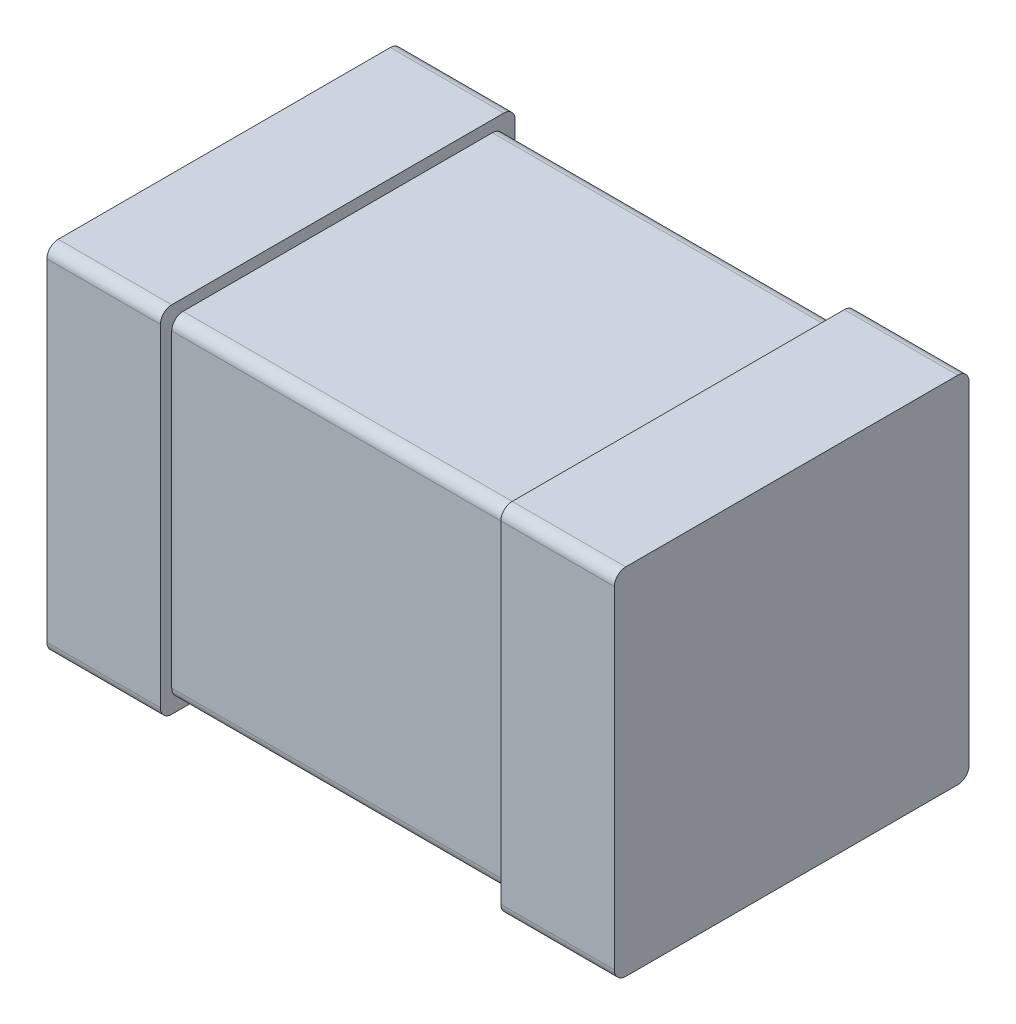
ISO-10303-21;
HEADER;
FILE_DESCRIPTION(('STEP AP214'),'2;1');
FILE_NAME('part.step','',(''),(''),'','','');
FILE_SCHEMA(('AUTOMOTIVE_DESIGN { 1 0 10303 214 1 1 1 1 }'));
ENDSEC;
DATA;
#1=APPLICATION_CONTEXT('core data for automotive mechanical design processes');
#2=APPLICATION_PROTOCOL_DEFINITION('international standard','automotive_design',2000,#1);
#3=PRODUCT_CONTEXT('',#1,'mechanical');
#4=PRODUCT('Part','Part','',(#3));
#5=PRODUCT_RELATED_PRODUCT_CATEGORY('part','',(#4));
#6=PRODUCT_DEFINITION_FORMATION('','',#4);
#7=PRODUCT_DEFINITION_CONTEXT('part definition',#1,'design');
#8=PRODUCT_DEFINITION('design','',#6,#7);
#9=PRODUCT_DEFINITION_SHAPE('','',#8);
#10=(LENGTH_UNIT() NAMED_UNIT(*) SI_UNIT(.MILLI.,.METRE.));
#11=(NAMED_UNIT(*) PLANE_ANGLE_UNIT() SI_UNIT($,.RADIAN.));
#12=(NAMED_UNIT(*) SI_UNIT($,.STERADIAN.) SOLID_ANGLE_UNIT());
#13=UNCERTAINTY_MEASURE_WITH_UNIT(LENGTH_MEASURE(1.E-05),#10,'distance_accuracy_value','');
#14=(GEOMETRIC_REPRESENTATION_CONTEXT(3) GLOBAL_UNCERTAINTY_ASSIGNED_CONTEXT((#13)) GLOBAL_UNIT_ASSIGNED_CONTEXT((#10,
#11,#12)) REPRESENTATION_CONTEXT('',''));
#15=CARTESIAN_POINT('',(0.,0.,0.));
#16=DIRECTION('',(0.,0.,1.));
#17=DIRECTION('',(1.,0.,0.));
#18=AXIS2_PLACEMENT_3D('',#15,#16,#17);
#19=CARTESIAN_POINT('',(1.,-0.625,0.));
#20=DIRECTION('',(1.,0.,0.));
#21=DIRECTION('',(0.,1.,0.));
#22=AXIS2_PLACEMENT_3D('',#19,#20,#21);
#23=PLANE('',#22);
#24=DIRECTION('',(0.,0.,1.));
#25=VECTOR('',#24,1.);
#26=CARTESIAN_POINT('',(1.,-0.625,0.));
#27=LINE('',#26,#25);
#28=CARTESIAN_POINT('',(1.,-0.625,0.04));
#29=VERTEX_POINT('',#28);
#30=CARTESIAN_POINT('',(1.,-0.625,1.21));
#31=VERTEX_POINT('',#30);
#32=EDGE_CURVE('E333',#29,#31,#27,.T.);
#33=ORIENTED_EDGE('',*,*,#32,.F.);
#34=CARTESIAN_POINT('',(1.,-0.585,0.04));
#35=DIRECTION('',(1.,0.,0.));
#36=DIRECTION('',(0.,0.,1.));
#37=AXIS2_PLACEMENT_3D('',#34,#35,#36);
#38=CIRCLE('',#37,0.04);
#39=CARTESIAN_POINT('',(1.,-0.585,0.));
#40=VERTEX_POINT('',#39);
#41=EDGE_CURVE('E315',#29,#40,#38,.T.);
#42=ORIENTED_EDGE('',*,*,#41,.T.);
#43=DIRECTION('',(0.,1.,0.));
#44=VECTOR('',#43,1.);
#45=CARTESIAN_POINT('',(1.,-0.625,0.));
#46=LINE('',#45,#44);
#47=CARTESIAN_POINT('',(1.,0.585,0.));
#48=VERTEX_POINT('',#47);
#49=EDGE_CURVE('E302',#40,#48,#46,.T.);
#50=ORIENTED_EDGE('',*,*,#49,.T.);
#51=CARTESIAN_POINT('',(1.,0.585,0.04));
#52=DIRECTION('',(-1.,0.,0.));
#53=DIRECTION('',(0.,0.,1.));
#54=AXIS2_PLACEMENT_3D('',#51,#52,#53);
#55=CIRCLE('',#54,0.04);
#56=CARTESIAN_POINT('',(1.,0.625,0.04));
#57=VERTEX_POINT('',#56);
#58=EDGE_CURVE('E207',#57,#48,#55,.T.);
#59=ORIENTED_EDGE('',*,*,#58,.F.);
#60=DIRECTION('',(0.,0.,1.));
#61=VECTOR('',#60,1.);
#62=CARTESIAN_POINT('',(1.,0.625,0.));
#63=LINE('',#62,#61);
#64=CARTESIAN_POINT('',(1.,0.625,1.21));
#65=VERTEX_POINT('',#64);
#66=EDGE_CURVE('E11',#57,#65,#63,.T.);
#67=ORIENTED_EDGE('',*,*,#66,.T.);
#68=CARTESIAN_POINT('',(1.,0.585,1.21));
#69=DIRECTION('',(1.,0.,0.));
#70=DIRECTION('',(0.,0.,1.));
#71=AXIS2_PLACEMENT_3D('',#68,#69,#70);
#72=CIRCLE('',#71,0.04);
#73=CARTESIAN_POINT('',(1.,0.585,1.25));
#74=VERTEX_POINT('',#73);
#75=EDGE_CURVE('E197',#65,#74,#72,.T.);
#76=ORIENTED_EDGE('',*,*,#75,.T.);
#77=DIRECTION('',(0.,1.,0.));
#78=VECTOR('',#77,1.);
#79=CARTESIAN_POINT('',(1.,-0.625,1.25));
#80=LINE('',#79,#78);
#81=CARTESIAN_POINT('',(1.,-0.585,1.25));
#82=VERTEX_POINT('',#81);
#83=EDGE_CURVE('E305',#82,#74,#80,.T.);
#84=ORIENTED_EDGE('',*,*,#83,.F.);
#85=CARTESIAN_POINT('',(1.,-0.585,1.21));
#86=DIRECTION('',(-1.,0.,0.));
#87=DIRECTION('',(0.,0.,1.));
#88=AXIS2_PLACEMENT_3D('',#85,#86,#87);
#89=CIRCLE('',#88,0.04);
#90=EDGE_CURVE('E311',#31,#82,#89,.T.);
#91=ORIENTED_EDGE('',*,*,#90,.F.);
#92=EDGE_LOOP('',(#33,#42,#50,#59,#67,#76,#84,#91));
#93=FACE_BOUND('',#92,.T.);
#94=ADVANCED_FACE('F16',(#93),#23,.T.);
#95=CARTESIAN_POINT('',(0.6,0.625,0.));
#96=DIRECTION('',(0.,1.,0.));
#97=DIRECTION('',(1.,0.,0.));
#98=AXIS2_PLACEMENT_3D('',#95,#96,#97);
#99=PLANE('',#98);
#100=ORIENTED_EDGE('',*,*,#66,.F.);
#101=DIRECTION('',(1.,0.,0.));
#102=VECTOR('',#101,1.);
#103=CARTESIAN_POINT('',(0.6,0.625,0.04));
#104=LINE('',#103,#102);
#105=CARTESIAN_POINT('',(0.6,0.625,0.04));
#106=VERTEX_POINT('',#105);
#107=EDGE_CURVE('E344',#106,#57,#104,.T.);
#108=ORIENTED_EDGE('',*,*,#107,.F.);
#109=DIRECTION('',(0.,0.,1.));
#110=VECTOR('',#109,1.);
#111=CARTESIAN_POINT('',(0.6,0.625,0.));
#112=LINE('',#111,#110);
#113=CARTESIAN_POINT('',(0.6,0.625,1.21));
#114=VERTEX_POINT('',#113);
#115=EDGE_CURVE('E390',#106,#114,#112,.T.);
#116=ORIENTED_EDGE('',*,*,#115,.T.);
#117=DIRECTION('',(1.,0.,0.));
#118=VECTOR('',#117,1.);
#119=CARTESIAN_POINT('',(0.6,0.625,1.21));
#120=LINE('',#119,#118);
#121=EDGE_CURVE('E27',#114,#65,#120,.T.);
#122=ORIENTED_EDGE('',*,*,#121,.T.);
#123=EDGE_LOOP('',(#100,#108,#116,#122));
#124=FACE_BOUND('',#123,.T.);
#125=ADVANCED_FACE('F578',(#124),#99,.T.);
#126=CARTESIAN_POINT('',(0.6,0.585,1.21));
#127=DIRECTION('',(1.,0.,0.));
#128=DIRECTION('',(0.,1.,0.));
#129=AXIS2_PLACEMENT_3D('',#126,#127,#128);
#130=CYLINDRICAL_SURFACE('',#129,0.04);
#131=CARTESIAN_POINT('',(0.6,0.585,1.21));
#132=DIRECTION('',(1.,0.,0.));
#133=DIRECTION('',(0.,0.,1.));
#134=AXIS2_PLACEMENT_3D('',#131,#132,#133);
#135=CIRCLE('',#134,0.04);
#136=CARTESIAN_POINT('',(0.6,0.585,1.25));
#137=VERTEX_POINT('',#136);
#138=EDGE_CURVE('E441',#114,#137,#135,.T.);
#139=ORIENTED_EDGE('',*,*,#138,.T.);
#140=DIRECTION('',(1.,0.,0.));
#141=VECTOR('',#140,1.);
#142=CARTESIAN_POINT('',(0.6,0.585,1.25));
#143=LINE('',#142,#141);
#144=EDGE_CURVE('E347',#137,#74,#143,.T.);
#145=ORIENTED_EDGE('',*,*,#144,.T.);
#146=ORIENTED_EDGE('',*,*,#75,.F.);
#147=ORIENTED_EDGE('',*,*,#121,.F.);
#148=EDGE_LOOP('',(#139,#145,#146,#147));
#149=FACE_BOUND('',#148,.T.);
#150=ADVANCED_FACE('F583',(#149),#130,.T.);
#151=CARTESIAN_POINT('',(0.6,0.585,0.04));
#152=DIRECTION('',(1.,0.,0.));
#153=DIRECTION('',(0.,1.,0.));
#154=AXIS2_PLACEMENT_3D('',#151,#152,#153);
#155=CYLINDRICAL_SURFACE('',#154,0.04);
#156=ORIENTED_EDGE('',*,*,#107,.T.);
#157=ORIENTED_EDGE('',*,*,#58,.T.);
#158=DIRECTION('',(1.,0.,0.));
#159=VECTOR('',#158,1.);
#160=CARTESIAN_POINT('',(0.6,0.585,0.));
#161=LINE('',#160,#159);
#162=CARTESIAN_POINT('',(0.6,0.585,0.));
#163=VERTEX_POINT('',#162);
#164=EDGE_CURVE('E306',#163,#48,#161,.T.);
#165=ORIENTED_EDGE('',*,*,#164,.F.);
#166=CARTESIAN_POINT('',(0.6,0.585,0.04));
#167=DIRECTION('',(-1.,0.,0.));
#168=DIRECTION('',(0.,0.,1.));
#169=AXIS2_PLACEMENT_3D('',#166,#167,#168);
#170=CIRCLE('',#169,0.04);
#171=EDGE_CURVE('E386',#106,#163,#170,.T.);
#172=ORIENTED_EDGE('',*,*,#171,.F.);
#173=EDGE_LOOP('',(#156,#157,#165,#172));
#174=FACE_BOUND('',#173,.T.);
#175=ADVANCED_FACE('F655',(#174),#155,.T.);
#176=CARTESIAN_POINT('',(0.6,-0.625,1.25));
#177=DIRECTION('',(0.,0.,1.));
#178=DIRECTION('',(1.,0.,0.));
#179=AXIS2_PLACEMENT_3D('',#176,#177,#178);
#180=PLANE('',#179);
#181=DIRECTION('',(0.,1.,0.));
#182=VECTOR('',#181,1.);
#183=CARTESIAN_POINT('',(0.6,-0.625,1.25));
#184=LINE('',#183,#182);
#185=CARTESIAN_POINT('',(0.6,-0.585,1.25));
#186=VERTEX_POINT('',#185);
#187=EDGE_CURVE('E437',#186,#137,#184,.T.);
#188=ORIENTED_EDGE('',*,*,#187,.F.);
#189=DIRECTION('',(1.,0.,0.));
#190=VECTOR('',#189,1.);
#191=CARTESIAN_POINT('',(0.6,-0.585,1.25));
#192=LINE('',#191,#190);
#193=EDGE_CURVE('E307',#186,#82,#192,.T.);
#194=ORIENTED_EDGE('',*,*,#193,.T.);
#195=ORIENTED_EDGE('',*,*,#83,.T.);
#196=ORIENTED_EDGE('',*,*,#144,.F.);
#197=EDGE_LOOP('',(#188,#194,#195,#196));
#198=FACE_BOUND('',#197,.T.);
#199=ADVANCED_FACE('F669',(#198),#180,.T.);
#200=CARTESIAN_POINT('',(0.6,-0.625,0.));
#201=DIRECTION('',(0.,0.,1.));
#202=DIRECTION('',(1.,0.,0.));
#203=AXIS2_PLACEMENT_3D('',#200,#201,#202);
#204=PLANE('',#203);
#205=ORIENTED_EDGE('',*,*,#164,.T.);
#206=ORIENTED_EDGE('',*,*,#49,.F.);
#207=DIRECTION('',(1.,0.,0.));
#208=VECTOR('',#207,1.);
#209=CARTESIAN_POINT('',(0.6,-0.585,0.));
#210=LINE('',#209,#208);
#211=CARTESIAN_POINT('',(0.6,-0.585,0.));
#212=VERTEX_POINT('',#211);
#213=EDGE_CURVE('E337',#212,#40,#210,.T.);
#214=ORIENTED_EDGE('',*,*,#213,.F.);
#215=DIRECTION('',(0.,1.,0.));
#216=VECTOR('',#215,1.);
#217=CARTESIAN_POINT('',(0.6,-0.625,0.));
#218=LINE('',#217,#216);
#219=EDGE_CURVE('E375',#212,#163,#218,.T.);
#220=ORIENTED_EDGE('',*,*,#219,.T.);
#221=EDGE_LOOP('',(#205,#206,#214,#220));
#222=FACE_BOUND('',#221,.T.);
#223=ADVANCED_FACE('F663',(#222),#204,.F.);
#224=CARTESIAN_POINT('',(0.6,-0.585,1.21));
#225=DIRECTION('',(1.,0.,0.));
#226=DIRECTION('',(0.,-1.,0.));
#227=AXIS2_PLACEMENT_3D('',#224,#225,#226);
#228=CYLINDRICAL_SURFACE('',#227,0.04);
#229=DIRECTION('',(1.,0.,0.));
#230=VECTOR('',#229,1.);
#231=CARTESIAN_POINT('',(0.6,-0.625,1.21));
#232=LINE('',#231,#230);
#233=CARTESIAN_POINT('',(0.6,-0.625,1.21));
#234=VERTEX_POINT('',#233);
#235=EDGE_CURVE('E276',#234,#31,#232,.T.);
#236=ORIENTED_EDGE('',*,*,#235,.T.);
#237=ORIENTED_EDGE('',*,*,#90,.T.);
#238=ORIENTED_EDGE('',*,*,#193,.F.);
#239=CARTESIAN_POINT('',(0.6,-0.585,1.21));
#240=DIRECTION('',(-1.,0.,0.));
#241=DIRECTION('',(0.,0.,1.));
#242=AXIS2_PLACEMENT_3D('',#239,#240,#241);
#243=CIRCLE('',#242,0.04);
#244=EDGE_CURVE('E378',#234,#186,#243,.T.);
#245=ORIENTED_EDGE('',*,*,#244,.F.);
#246=EDGE_LOOP('',(#236,#237,#238,#245));
#247=FACE_BOUND('',#246,.T.);
#248=ADVANCED_FACE('F668',(#247),#228,.T.);
#249=CARTESIAN_POINT('',(0.6,-0.585,0.04));
#250=DIRECTION('',(1.,0.,0.));
#251=DIRECTION('',(0.,-1.,0.));
#252=AXIS2_PLACEMENT_3D('',#249,#250,#251);
#253=CYLINDRICAL_SURFACE('',#252,0.04);
#254=CARTESIAN_POINT('',(0.6,-0.585,0.04));
#255=DIRECTION('',(1.,0.,0.));
#256=DIRECTION('',(0.,0.,1.));
#257=AXIS2_PLACEMENT_3D('',#254,#255,#256);
#258=CIRCLE('',#257,0.04);
#259=CARTESIAN_POINT('',(0.6,-0.625,0.04));
#260=VERTEX_POINT('',#259);
#261=EDGE_CURVE('E323',#260,#212,#258,.T.);
#262=ORIENTED_EDGE('',*,*,#261,.T.);
#263=ORIENTED_EDGE('',*,*,#213,.T.);
#264=ORIENTED_EDGE('',*,*,#41,.F.);
#265=DIRECTION('',(1.,0.,0.));
#266=VECTOR('',#265,1.);
#267=CARTESIAN_POINT('',(0.6,-0.625,0.04));
#268=LINE('',#267,#266);
#269=EDGE_CURVE('E280',#260,#29,#268,.T.);
#270=ORIENTED_EDGE('',*,*,#269,.F.);
#271=EDGE_LOOP('',(#262,#263,#264,#270));
#272=FACE_BOUND('',#271,.T.);
#273=ADVANCED_FACE('F597',(#272),#253,.T.);
#274=CARTESIAN_POINT('',(0.6,-0.625,0.));
#275=DIRECTION('',(0.,1.,0.));
#276=DIRECTION('',(1.,0.,0.));
#277=AXIS2_PLACEMENT_3D('',#274,#275,#276);
#278=PLANE('',#277);
#279=ORIENTED_EDGE('',*,*,#235,.F.);
#280=DIRECTION('',(0.,0.,1.));
#281=VECTOR('',#280,1.);
#282=CARTESIAN_POINT('',(0.6,-0.625,0.));
#283=LINE('',#282,#281);
#284=EDGE_CURVE('E281',#260,#234,#283,.T.);
#285=ORIENTED_EDGE('',*,*,#284,.F.);
#286=ORIENTED_EDGE('',*,*,#269,.T.);
#287=ORIENTED_EDGE('',*,*,#32,.T.);
#288=EDGE_LOOP('',(#279,#285,#286,#287));
#289=FACE_BOUND('',#288,.T.);
#290=ADVANCED_FACE('F592',(#289),#278,.F.);
#291=CARTESIAN_POINT('',(0.6,-0.625,0.));
#292=DIRECTION('',(1.,0.,0.));
#293=DIRECTION('',(0.,1.,0.));
#294=AXIS2_PLACEMENT_3D('',#291,#292,#293);
#295=PLANE('',#294);
#296=DIRECTION('',(0.,1.,0.));
#297=VECTOR('',#296,1.);
#298=CARTESIAN_POINT('',(0.6,-0.585,0.04));
#299=LINE('',#298,#297);
#300=CARTESIAN_POINT('',(0.6,-0.545,0.04));
#301=VERTEX_POINT('',#300);
#302=CARTESIAN_POINT('',(0.6,0.545,0.04));
#303=VERTEX_POINT('',#302);
#304=EDGE_CURVE('E327',#301,#303,#299,.T.);
#305=ORIENTED_EDGE('',*,*,#304,.T.);
#306=CARTESIAN_POINT('',(0.6,0.545,0.08));
#307=DIRECTION('',(-1.,0.,0.));
#308=DIRECTION('',(0.,0.,1.));
#309=AXIS2_PLACEMENT_3D('',#306,#307,#308);
#310=CIRCLE('',#309,0.04);
#311=CARTESIAN_POINT('',(0.6,0.585,0.08));
#312=VERTEX_POINT('',#311);
#313=EDGE_CURVE('E358',#312,#303,#310,.T.);
#314=ORIENTED_EDGE('',*,*,#313,.F.);
#315=DIRECTION('',(0.,0.,1.));
#316=VECTOR('',#315,1.);
#317=CARTESIAN_POINT('',(0.6,0.585,0.04));
#318=LINE('',#317,#316);
#319=CARTESIAN_POINT('',(0.6,0.585,1.17));
#320=VERTEX_POINT('',#319);
#321=EDGE_CURVE('E188',#312,#320,#318,.T.);
#322=ORIENTED_EDGE('',*,*,#321,.T.);
#323=CARTESIAN_POINT('',(0.6,0.545,1.17));
#324=DIRECTION('',(1.,0.,0.));
#325=DIRECTION('',(0.,0.,1.));
#326=AXIS2_PLACEMENT_3D('',#323,#324,#325);
#327=CIRCLE('',#326,0.04);
#328=CARTESIAN_POINT('',(0.6,0.545,1.21));
#329=VERTEX_POINT('',#328);
#330=EDGE_CURVE('E178',#320,#329,#327,.T.);
#331=ORIENTED_EDGE('',*,*,#330,.T.);
#332=DIRECTION('',(0.,1.,0.));
#333=VECTOR('',#332,1.);
#334=CARTESIAN_POINT('',(0.6,-0.585,1.21));
#335=LINE('',#334,#333);
#336=CARTESIAN_POINT('',(0.6,-0.545,1.21));
#337=VERTEX_POINT('',#336);
#338=EDGE_CURVE('E274',#337,#329,#335,.T.);
#339=ORIENTED_EDGE('',*,*,#338,.F.);
#340=CARTESIAN_POINT('',(0.6,-0.545,1.17));
#341=DIRECTION('',(-1.,0.,0.));
#342=DIRECTION('',(0.,0.,1.));
#343=AXIS2_PLACEMENT_3D('',#340,#341,#342);
#344=CIRCLE('',#343,0.04);
#345=CARTESIAN_POINT('',(0.6,-0.585,1.17));
#346=VERTEX_POINT('',#345);
#347=EDGE_CURVE('E273',#346,#337,#344,.T.);
#348=ORIENTED_EDGE('',*,*,#347,.F.);
#349=DIRECTION('',(0.,0.,1.));
#350=VECTOR('',#349,1.);
#351=CARTESIAN_POINT('',(0.6,-0.585,0.04));
#352=LINE('',#351,#350);
#353=CARTESIAN_POINT('',(0.6,-0.585,0.08));
#354=VERTEX_POINT('',#353);
#355=EDGE_CURVE('E295',#354,#346,#352,.T.);
#356=ORIENTED_EDGE('',*,*,#355,.F.);
#357=CARTESIAN_POINT('',(0.6,-0.545,0.08));
#358=DIRECTION('',(1.,0.,0.));
#359=DIRECTION('',(0.,0.,1.));
#360=AXIS2_PLACEMENT_3D('',#357,#358,#359);
#361=CIRCLE('',#360,0.04);
#362=EDGE_CURVE('E447',#354,#301,#361,.T.);
#363=ORIENTED_EDGE('',*,*,#362,.T.);
#364=EDGE_LOOP('',(#305,#314,#322,#331,#339,#348,#356,#363));
#365=FACE_BOUND('',#364,.T.);
#366=ORIENTED_EDGE('',*,*,#244,.T.);
#367=ORIENTED_EDGE('',*,*,#187,.T.);
#368=ORIENTED_EDGE('',*,*,#138,.F.);
#369=ORIENTED_EDGE('',*,*,#115,.F.);
#370=ORIENTED_EDGE('',*,*,#171,.T.);
#371=ORIENTED_EDGE('',*,*,#219,.F.);
#372=ORIENTED_EDGE('',*,*,#261,.F.);
#373=ORIENTED_EDGE('',*,*,#284,.T.);
#374=EDGE_LOOP('',(#366,#367,#368,#369,#370,#371,#372,#373));
#375=FACE_BOUND('',#374,.T.);
#376=ADVANCED_FACE('F504',(#365,#375),#295,.F.);
#377=CARTESIAN_POINT('',(-0.6,-0.585,0.04));
#378=DIRECTION('',(0.,1.,0.));
#379=DIRECTION('',(1.,0.,0.));
#380=AXIS2_PLACEMENT_3D('',#377,#378,#379);
#381=PLANE('',#380);
#382=DIRECTION('',(1.,0.,0.));
#383=VECTOR('',#382,1.);
#384=CARTESIAN_POINT('',(-0.6,-0.585,1.17));
#385=LINE('',#384,#383);
#386=CARTESIAN_POINT('',(-0.6,-0.585,1.17));
#387=VERTEX_POINT('',#386);
#388=EDGE_CURVE('E271',#387,#346,#385,.T.);
#389=ORIENTED_EDGE('',*,*,#388,.F.);
#390=DIRECTION('',(0.,0.,1.));
#391=VECTOR('',#390,1.);
#392=CARTESIAN_POINT('',(-0.6,-0.585,0.04));
#393=LINE('',#392,#391);
#394=CARTESIAN_POINT('',(-0.6,-0.585,0.08));
#395=VERTEX_POINT('',#394);
#396=EDGE_CURVE('E364',#395,#387,#393,.T.);
#397=ORIENTED_EDGE('',*,*,#396,.F.);
#398=DIRECTION('',(1.,0.,0.));
#399=VECTOR('',#398,1.);
#400=CARTESIAN_POINT('',(-0.6,-0.585,0.08));
#401=LINE('',#400,#399);
#402=EDGE_CURVE('E351',#395,#354,#401,.T.);
#403=ORIENTED_EDGE('',*,*,#402,.T.);
#404=ORIENTED_EDGE('',*,*,#355,.T.);
#405=EDGE_LOOP('',(#389,#397,#403,#404));
#406=FACE_BOUND('',#405,.T.);
#407=ADVANCED_FACE('F529',(#406),#381,.F.);
#408=CARTESIAN_POINT('',(-0.6,-0.545,1.17));
#409=DIRECTION('',(1.,0.,0.));
#410=DIRECTION('',(0.,-1.,0.));
#411=AXIS2_PLACEMENT_3D('',#408,#409,#410);
#412=CYLINDRICAL_SURFACE('',#411,0.04);
#413=ORIENTED_EDGE('',*,*,#388,.T.);
#414=ORIENTED_EDGE('',*,*,#347,.T.);
#415=DIRECTION('',(1.,0.,0.));
#416=VECTOR('',#415,1.);
#417=CARTESIAN_POINT('',(-0.6,-0.545,1.21));
#418=LINE('',#417,#416);
#419=CARTESIAN_POINT('',(-0.6,-0.545,1.21));
#420=VERTEX_POINT('',#419);
#421=EDGE_CURVE('E393',#420,#337,#418,.T.);
#422=ORIENTED_EDGE('',*,*,#421,.F.);
#423=CARTESIAN_POINT('',(-0.6,-0.545,1.17));
#424=DIRECTION('',(-1.,0.,0.));
#425=DIRECTION('',(0.,0.,1.));
#426=AXIS2_PLACEMENT_3D('',#423,#424,#425);
#427=CIRCLE('',#426,0.04);
#428=EDGE_CURVE('E359',#387,#420,#427,.T.);
#429=ORIENTED_EDGE('',*,*,#428,.F.);
#430=EDGE_LOOP('',(#413,#414,#422,#429));
#431=FACE_BOUND('',#430,.T.);
#432=ADVANCED_FACE('F525',(#431),#412,.T.);
#433=CARTESIAN_POINT('',(-0.6,-0.585,1.21));
#434=DIRECTION('',(0.,0.,1.));
#435=DIRECTION('',(1.,0.,0.));
#436=AXIS2_PLACEMENT_3D('',#433,#434,#435);
#437=PLANE('',#436);
#438=DIRECTION('',(0.,1.,0.));
#439=VECTOR('',#438,1.);
#440=CARTESIAN_POINT('',(-0.6,-0.585,1.21));
#441=LINE('',#440,#439);
#442=CARTESIAN_POINT('',(-0.6,0.545,1.21));
#443=VERTEX_POINT('',#442);
#444=EDGE_CURVE('E363',#420,#443,#441,.T.);
#445=ORIENTED_EDGE('',*,*,#444,.F.);
#446=ORIENTED_EDGE('',*,*,#421,.T.);
#447=ORIENTED_EDGE('',*,*,#338,.T.);
#448=DIRECTION('',(1.,0.,0.));
#449=VECTOR('',#448,1.);
#450=CARTESIAN_POINT('',(-0.6,0.545,1.21));
#451=LINE('',#450,#449);
#452=EDGE_CURVE('E427',#443,#329,#451,.T.);
#453=ORIENTED_EDGE('',*,*,#452,.F.);
#454=EDGE_LOOP('',(#445,#446,#447,#453));
#455=FACE_BOUND('',#454,.T.);
#456=ADVANCED_FACE('F18',(#455),#437,.T.);
#457=CARTESIAN_POINT('',(-0.6,0.545,1.17));
#458=DIRECTION('',(1.,0.,0.));
#459=DIRECTION('',(0.,1.,0.));
#460=AXIS2_PLACEMENT_3D('',#457,#458,#459);
#461=CYLINDRICAL_SURFACE('',#460,0.04);
#462=CARTESIAN_POINT('',(-0.6,0.545,1.17));
#463=DIRECTION('',(1.,0.,0.));
#464=DIRECTION('',(0.,0.,1.));
#465=AXIS2_PLACEMENT_3D('',#462,#463,#464);
#466=CIRCLE('',#465,0.04);
#467=CARTESIAN_POINT('',(-0.6,0.585,1.17));
#468=VERTEX_POINT('',#467);
#469=EDGE_CURVE('E385',#468,#443,#466,.T.);
#470=ORIENTED_EDGE('',*,*,#469,.T.);
#471=ORIENTED_EDGE('',*,*,#452,.T.);
#472=ORIENTED_EDGE('',*,*,#330,.F.);
#473=DIRECTION('',(1.,0.,0.));
#474=VECTOR('',#473,1.);
#475=CARTESIAN_POINT('',(-0.6,0.585,1.17));
#476=LINE('',#475,#474);
#477=EDGE_CURVE('E381',#468,#320,#476,.T.);
#478=ORIENTED_EDGE('',*,*,#477,.F.);
#479=EDGE_LOOP('',(#470,#471,#472,#478));
#480=FACE_BOUND('',#479,.T.);
#481=ADVANCED_FACE('F518',(#480),#461,.T.);
#482=CARTESIAN_POINT('',(-0.6,0.585,0.04));
#483=DIRECTION('',(0.,1.,0.));
#484=DIRECTION('',(1.,0.,0.));
#485=AXIS2_PLACEMENT_3D('',#482,#483,#484);
#486=PLANE('',#485);
#487=ORIENTED_EDGE('',*,*,#321,.F.);
#488=DIRECTION('',(1.,0.,0.));
#489=VECTOR('',#488,1.);
#490=CARTESIAN_POINT('',(-0.6,0.585,0.08));
#491=LINE('',#490,#489);
#492=CARTESIAN_POINT('',(-0.6,0.585,0.08));
#493=VERTEX_POINT('',#492);
#494=EDGE_CURVE('E331',#493,#312,#491,.T.);
#495=ORIENTED_EDGE('',*,*,#494,.F.);
#496=DIRECTION('',(0.,0.,1.));
#497=VECTOR('',#496,1.);
#498=CARTESIAN_POINT('',(-0.6,0.585,0.04));
#499=LINE('',#498,#497);
#500=EDGE_CURVE('E343',#493,#468,#499,.T.);
#501=ORIENTED_EDGE('',*,*,#500,.T.);
#502=ORIENTED_EDGE('',*,*,#477,.T.);
#503=EDGE_LOOP('',(#487,#495,#501,#502));
#504=FACE_BOUND('',#503,.T.);
#505=ADVANCED_FACE('F515',(#504),#486,.T.);
#506=CARTESIAN_POINT('',(-0.6,0.545,0.08));
#507=DIRECTION('',(1.,0.,0.));
#508=DIRECTION('',(0.,1.,0.));
#509=AXIS2_PLACEMENT_3D('',#506,#507,#508);
#510=CYLINDRICAL_SURFACE('',#509,0.04);
#511=ORIENTED_EDGE('',*,*,#494,.T.);
#512=ORIENTED_EDGE('',*,*,#313,.T.);
#513=DIRECTION('',(1.,0.,0.));
#514=VECTOR('',#513,1.);
#515=CARTESIAN_POINT('',(-0.6,0.545,0.04));
#516=LINE('',#515,#514);
#517=CARTESIAN_POINT('',(-0.6,0.545,0.04));
#518=VERTEX_POINT('',#517);
#519=EDGE_CURVE('E332',#518,#303,#516,.T.);
#520=ORIENTED_EDGE('',*,*,#519,.F.);
#521=CARTESIAN_POINT('',(-0.6,0.545,0.08));
#522=DIRECTION('',(-1.,0.,0.));
#523=DIRECTION('',(0.,0.,1.));
#524=AXIS2_PLACEMENT_3D('',#521,#522,#523);
#525=CIRCLE('',#524,0.04);
#526=EDGE_CURVE('E338',#493,#518,#525,.T.);
#527=ORIENTED_EDGE('',*,*,#526,.F.);
#528=EDGE_LOOP('',(#511,#512,#520,#527));
#529=FACE_BOUND('',#528,.T.);
#530=ADVANCED_FACE('F500',(#529),#510,.T.);
#531=CARTESIAN_POINT('',(-0.6,-0.585,0.04));
#532=DIRECTION('',(0.,0.,1.));
#533=DIRECTION('',(1.,0.,0.));
#534=AXIS2_PLACEMENT_3D('',#531,#532,#533);
#535=PLANE('',#534);
#536=ORIENTED_EDGE('',*,*,#519,.T.);
#537=ORIENTED_EDGE('',*,*,#304,.F.);
#538=DIRECTION('',(1.,0.,0.));
#539=VECTOR('',#538,1.);
#540=CARTESIAN_POINT('',(-0.6,-0.545,0.04));
#541=LINE('',#540,#539);
#542=CARTESIAN_POINT('',(-0.6,-0.545,0.04));
#543=VERTEX_POINT('',#542);
#544=EDGE_CURVE('E20',#543,#301,#541,.T.);
#545=ORIENTED_EDGE('',*,*,#544,.F.);
#546=DIRECTION('',(0.,1.,0.));
#547=VECTOR('',#546,1.);
#548=CARTESIAN_POINT('',(-0.6,-0.585,0.04));
#549=LINE('',#548,#547);
#550=EDGE_CURVE('E342',#543,#518,#549,.T.);
#551=ORIENTED_EDGE('',*,*,#550,.T.);
#552=EDGE_LOOP('',(#536,#537,#545,#551));
#553=FACE_BOUND('',#552,.T.);
#554=ADVANCED_FACE('F509',(#553),#535,.F.);
#555=CARTESIAN_POINT('',(-0.6,-0.545,0.08));
#556=DIRECTION('',(1.,0.,0.));
#557=DIRECTION('',(0.,-1.,0.));
#558=AXIS2_PLACEMENT_3D('',#555,#556,#557);
#559=CYLINDRICAL_SURFACE('',#558,0.04);
#560=CARTESIAN_POINT('',(-0.6,-0.545,0.08));
#561=DIRECTION('',(1.,0.,0.));
#562=DIRECTION('',(0.,0.,1.));
#563=AXIS2_PLACEMENT_3D('',#560,#561,#562);
#564=CIRCLE('',#563,0.04);
#565=EDGE_CURVE('E405',#395,#543,#564,.T.);
#566=ORIENTED_EDGE('',*,*,#565,.T.);
#567=ORIENTED_EDGE('',*,*,#544,.T.);
#568=ORIENTED_EDGE('',*,*,#362,.F.);
#569=ORIENTED_EDGE('',*,*,#402,.F.);
#570=EDGE_LOOP('',(#566,#567,#568,#569));
#571=FACE_BOUND('',#570,.T.);
#572=ADVANCED_FACE('F531',(#571),#559,.T.);
#573=CARTESIAN_POINT('',(-0.6,-0.625,0.));
#574=DIRECTION('',(1.,0.,0.));
#575=DIRECTION('',(0.,1.,0.));
#576=AXIS2_PLACEMENT_3D('',#573,#574,#575);
#577=PLANE('',#576);
#578=ORIENTED_EDGE('',*,*,#565,.F.);
#579=ORIENTED_EDGE('',*,*,#396,.T.);
#580=ORIENTED_EDGE('',*,*,#428,.T.);
#581=ORIENTED_EDGE('',*,*,#444,.T.);
#582=ORIENTED_EDGE('',*,*,#469,.F.);
#583=ORIENTED_EDGE('',*,*,#500,.F.);
#584=ORIENTED_EDGE('',*,*,#526,.T.);
#585=ORIENTED_EDGE('',*,*,#550,.F.);
#586=EDGE_LOOP('',(#578,#579,#580,#581,#582,#583,#584,#585));
#587=FACE_BOUND('',#586,.T.);
#588=DIRECTION('',(0.,0.,1.));
#589=VECTOR('',#588,1.);
#590=CARTESIAN_POINT('',(-0.6,-0.625,0.));
#591=LINE('',#590,#589);
#592=CARTESIAN_POINT('',(-0.6,-0.625,0.04));
#593=VERTEX_POINT('',#592);
#594=CARTESIAN_POINT('',(-0.6,-0.625,1.21));
#595=VERTEX_POINT('',#594);
#596=EDGE_CURVE('E291',#593,#595,#591,.T.);
#597=ORIENTED_EDGE('',*,*,#596,.F.);
#598=CARTESIAN_POINT('',(-0.6,-0.585,0.04));
#599=DIRECTION('',(1.,0.,0.));
#600=DIRECTION('',(0.,0.,1.));
#601=AXIS2_PLACEMENT_3D('',#598,#599,#600);
#602=CIRCLE('',#601,0.04);
#603=CARTESIAN_POINT('',(-0.6,-0.585,0.));
#604=VERTEX_POINT('',#603);
#605=EDGE_CURVE('E263',#593,#604,#602,.T.);
#606=ORIENTED_EDGE('',*,*,#605,.T.);
#607=DIRECTION('',(0.,1.,0.));
#608=VECTOR('',#607,1.);
#609=CARTESIAN_POINT('',(-0.6,-0.625,0.));
#610=LINE('',#609,#608);
#611=CARTESIAN_POINT('',(-0.6,0.585,0.));
#612=VERTEX_POINT('',#611);
#613=EDGE_CURVE('E227',#604,#612,#610,.T.);
#614=ORIENTED_EDGE('',*,*,#613,.T.);
#615=CARTESIAN_POINT('',(-0.6,0.585,0.04));
#616=DIRECTION('',(-1.,0.,0.));
#617=DIRECTION('',(0.,0.,1.));
#618=AXIS2_PLACEMENT_3D('',#615,#616,#617);
#619=CIRCLE('',#618,0.04);
#620=CARTESIAN_POINT('',(-0.6,0.625,0.04));
#621=VERTEX_POINT('',#620);
#622=EDGE_CURVE('E368',#621,#612,#619,.T.);
#623=ORIENTED_EDGE('',*,*,#622,.F.);
#624=DIRECTION('',(0.,0.,1.));
#625=VECTOR('',#624,1.);
#626=CARTESIAN_POINT('',(-0.6,0.625,0.));
#627=LINE('',#626,#625);
#628=CARTESIAN_POINT('',(-0.6,0.625,1.21));
#629=VERTEX_POINT('',#628);
#630=EDGE_CURVE('E409',#621,#629,#627,.T.);
#631=ORIENTED_EDGE('',*,*,#630,.T.);
#632=CARTESIAN_POINT('',(-0.6,0.585,1.21));
#633=DIRECTION('',(1.,0.,0.));
#634=DIRECTION('',(0.,0.,1.));
#635=AXIS2_PLACEMENT_3D('',#632,#633,#634);
#636=CIRCLE('',#635,0.04);
#637=CARTESIAN_POINT('',(-0.6,0.585,1.25));
#638=VERTEX_POINT('',#637);
#639=EDGE_CURVE('E241',#629,#638,#636,.T.);
#640=ORIENTED_EDGE('',*,*,#639,.T.);
#641=DIRECTION('',(0.,1.,0.));
#642=VECTOR('',#641,1.);
#643=CARTESIAN_POINT('',(-0.6,-0.625,1.25));
#644=LINE('',#643,#642);
#645=CARTESIAN_POINT('',(-0.6,-0.585,1.25));
#646=VERTEX_POINT('',#645);
#647=EDGE_CURVE('E233',#646,#638,#644,.T.);
#648=ORIENTED_EDGE('',*,*,#647,.F.);
#649=CARTESIAN_POINT('',(-0.6,-0.585,1.21));
#650=DIRECTION('',(-1.,0.,0.));
#651=DIRECTION('',(0.,0.,1.));
#652=AXIS2_PLACEMENT_3D('',#649,#650,#651);
#653=CIRCLE('',#652,0.04);
#654=EDGE_CURVE('E238',#595,#646,#653,.T.);
#655=ORIENTED_EDGE('',*,*,#654,.F.);
#656=EDGE_LOOP('',(#597,#606,#614,#623,#631,#640,#648,#655));
#657=FACE_BOUND('',#656,.T.);
#658=ADVANCED_FACE('F236',(#587,#657),#577,.T.);
#659=CARTESIAN_POINT('',(-1.,0.625,0.));
#660=DIRECTION('',(0.,1.,0.));
#661=DIRECTION('',(1.,0.,0.));
#662=AXIS2_PLACEMENT_3D('',#659,#660,#661);
#663=PLANE('',#662);
#664=ORIENTED_EDGE('',*,*,#630,.F.);
#665=DIRECTION('',(1.,0.,0.));
#666=VECTOR('',#665,1.);
#667=CARTESIAN_POINT('',(-1.,0.625,0.04));
#668=LINE('',#667,#666);
#669=CARTESIAN_POINT('',(-1.,0.625,0.04));
#670=VERTEX_POINT('',#669);
#671=EDGE_CURVE('E371',#670,#621,#668,.T.);
#672=ORIENTED_EDGE('',*,*,#671,.F.);
#673=DIRECTION('',(0.,0.,1.));
#674=VECTOR('',#673,1.);
#675=CARTESIAN_POINT('',(-1.,0.625,0.));
#676=LINE('',#675,#674);
#677=CARTESIAN_POINT('',(-1.,0.625,1.21));
#678=VERTEX_POINT('',#677);
#679=EDGE_CURVE('E286',#670,#678,#676,.T.);
#680=ORIENTED_EDGE('',*,*,#679,.T.);
#681=DIRECTION('',(1.,0.,0.));
#682=VECTOR('',#681,1.);
#683=CARTESIAN_POINT('',(-1.,0.625,1.21));
#684=LINE('',#683,#682);
#685=EDGE_CURVE('E367',#678,#629,#684,.T.);
#686=ORIENTED_EDGE('',*,*,#685,.T.);
#687=EDGE_LOOP('',(#664,#672,#680,#686));
#688=FACE_BOUND('',#687,.T.);
#689=ADVANCED_FACE('F630',(#688),#663,.T.);
#690=CARTESIAN_POINT('',(-1.,0.585,1.21));
#691=DIRECTION('',(1.,0.,0.));
#692=DIRECTION('',(0.,1.,0.));
#693=AXIS2_PLACEMENT_3D('',#690,#691,#692);
#694=CYLINDRICAL_SURFACE('',#693,0.04);
#695=CARTESIAN_POINT('',(-1.,0.585,1.21));
#696=DIRECTION('',(1.,0.,0.));
#697=DIRECTION('',(0.,0.,1.));
#698=AXIS2_PLACEMENT_3D('',#695,#696,#697);
#699=CIRCLE('',#698,0.04);
#700=CARTESIAN_POINT('',(-1.,0.585,1.25));
#701=VERTEX_POINT('',#700);
#702=EDGE_CURVE('E282',#678,#701,#699,.T.);
#703=ORIENTED_EDGE('',*,*,#702,.T.);
#704=DIRECTION('',(1.,0.,0.));
#705=VECTOR('',#704,1.);
#706=CARTESIAN_POINT('',(-1.,0.585,1.25));
#707=LINE('',#706,#705);
#708=EDGE_CURVE('E246',#701,#638,#707,.T.);
#709=ORIENTED_EDGE('',*,*,#708,.T.);
#710=ORIENTED_EDGE('',*,*,#639,.F.);
#711=ORIENTED_EDGE('',*,*,#685,.F.);
#712=EDGE_LOOP('',(#703,#709,#710,#711));
#713=FACE_BOUND('',#712,.T.);
#714=ADVANCED_FACE('F635',(#713),#694,.T.);
#715=CARTESIAN_POINT('',(-1.,0.585,0.04));
#716=DIRECTION('',(1.,0.,0.));
#717=DIRECTION('',(0.,1.,0.));
#718=AXIS2_PLACEMENT_3D('',#715,#716,#717);
#719=CYLINDRICAL_SURFACE('',#718,0.04);
#720=ORIENTED_EDGE('',*,*,#671,.T.);
#721=ORIENTED_EDGE('',*,*,#622,.T.);
#722=DIRECTION('',(1.,0.,0.));
#723=VECTOR('',#722,1.);
#724=CARTESIAN_POINT('',(-1.,0.585,0.));
#725=LINE('',#724,#723);
#726=CARTESIAN_POINT('',(-1.,0.585,0.));
#727=VERTEX_POINT('',#726);
#728=EDGE_CURVE('E257',#727,#612,#725,.T.);
#729=ORIENTED_EDGE('',*,*,#728,.F.);
#730=CARTESIAN_POINT('',(-1.,0.585,0.04));
#731=DIRECTION('',(-1.,0.,0.));
#732=DIRECTION('',(0.,0.,1.));
#733=AXIS2_PLACEMENT_3D('',#730,#731,#732);
#734=CIRCLE('',#733,0.04);
#735=EDGE_CURVE('E316',#670,#727,#734,.T.);
#736=ORIENTED_EDGE('',*,*,#735,.F.);
#737=EDGE_LOOP('',(#720,#721,#729,#736));
#738=FACE_BOUND('',#737,.T.);
#739=ADVANCED_FACE('F611',(#738),#719,.T.);
#740=CARTESIAN_POINT('',(-1.,-0.625,1.25));
#741=DIRECTION('',(0.,0.,1.));
#742=DIRECTION('',(1.,0.,0.));
#743=AXIS2_PLACEMENT_3D('',#740,#741,#742);
#744=PLANE('',#743);
#745=DIRECTION('',(0.,1.,0.));
#746=VECTOR('',#745,1.);
#747=CARTESIAN_POINT('',(-1.,-0.625,1.25));
#748=LINE('',#747,#746);
#749=CARTESIAN_POINT('',(-1.,-0.585,1.25));
#750=VERTEX_POINT('',#749);
#751=EDGE_CURVE('E252',#750,#701,#748,.T.);
#752=ORIENTED_EDGE('',*,*,#751,.F.);
#753=DIRECTION('',(1.,0.,0.));
#754=VECTOR('',#753,1.);
#755=CARTESIAN_POINT('',(-1.,-0.585,1.25));
#756=LINE('',#755,#754);
#757=EDGE_CURVE('E249',#750,#646,#756,.T.);
#758=ORIENTED_EDGE('',*,*,#757,.T.);
#759=ORIENTED_EDGE('',*,*,#647,.T.);
#760=ORIENTED_EDGE('',*,*,#708,.F.);
#761=EDGE_LOOP('',(#752,#758,#759,#760));
#762=FACE_BOUND('',#761,.T.);
#763=ADVANCED_FACE('F250',(#762),#744,.T.);
#764=CARTESIAN_POINT('',(-1.,-0.625,0.));
#765=DIRECTION('',(0.,0.,1.));
#766=DIRECTION('',(1.,0.,0.));
#767=AXIS2_PLACEMENT_3D('',#764,#765,#766);
#768=PLANE('',#767);
#769=ORIENTED_EDGE('',*,*,#728,.T.);
#770=ORIENTED_EDGE('',*,*,#613,.F.);
#771=DIRECTION('',(1.,0.,0.));
#772=VECTOR('',#771,1.);
#773=CARTESIAN_POINT('',(-1.,-0.585,0.));
#774=LINE('',#773,#772);
#775=CARTESIAN_POINT('',(-1.,-0.585,0.));
#776=VERTEX_POINT('',#775);
#777=EDGE_CURVE('E268',#776,#604,#774,.T.);
#778=ORIENTED_EDGE('',*,*,#777,.F.);
#779=DIRECTION('',(0.,1.,0.));
#780=VECTOR('',#779,1.);
#781=CARTESIAN_POINT('',(-1.,-0.625,0.));
#782=LINE('',#781,#780);
#783=EDGE_CURVE('E301',#776,#727,#782,.T.);
#784=ORIENTED_EDGE('',*,*,#783,.T.);
#785=EDGE_LOOP('',(#769,#770,#778,#784));
#786=FACE_BOUND('',#785,.T.);
#787=ADVANCED_FACE('F610',(#786),#768,.F.);
#788=CARTESIAN_POINT('',(-1.,-0.585,1.21));
#789=DIRECTION('',(1.,0.,0.));
#790=DIRECTION('',(0.,-1.,0.));
#791=AXIS2_PLACEMENT_3D('',#788,#789,#790);
#792=CYLINDRICAL_SURFACE('',#791,0.04);
#793=DIRECTION('',(1.,0.,0.));
#794=VECTOR('',#793,1.);
#795=CARTESIAN_POINT('',(-1.,-0.625,1.21));
#796=LINE('',#795,#794);
#797=CARTESIAN_POINT('',(-1.,-0.625,1.21));
#798=VERTEX_POINT('',#797);
#799=EDGE_CURVE('E261',#798,#595,#796,.T.);
#800=ORIENTED_EDGE('',*,*,#799,.T.);
#801=ORIENTED_EDGE('',*,*,#654,.T.);
#802=ORIENTED_EDGE('',*,*,#757,.F.);
#803=CARTESIAN_POINT('',(-1.,-0.585,1.21));
#804=DIRECTION('',(-1.,0.,0.));
#805=DIRECTION('',(0.,0.,1.));
#806=AXIS2_PLACEMENT_3D('',#803,#804,#805);
#807=CIRCLE('',#806,0.04);
#808=EDGE_CURVE('E419',#798,#750,#807,.T.);
#809=ORIENTED_EDGE('',*,*,#808,.F.);
#810=EDGE_LOOP('',(#800,#801,#802,#809));
#811=FACE_BOUND('',#810,.T.);
#812=ADVANCED_FACE('F260',(#811),#792,.T.);
#813=CARTESIAN_POINT('',(-1.,-0.585,0.04));
#814=DIRECTION('',(1.,0.,0.));
#815=DIRECTION('',(0.,-1.,0.));
#816=AXIS2_PLACEMENT_3D('',#813,#814,#815);
#817=CYLINDRICAL_SURFACE('',#816,0.04);
#818=CARTESIAN_POINT('',(-1.,-0.585,0.04));
#819=DIRECTION('',(1.,0.,0.));
#820=DIRECTION('',(0.,0.,1.));
#821=AXIS2_PLACEMENT_3D('',#818,#819,#820);
#822=CIRCLE('',#821,0.04);
#823=CARTESIAN_POINT('',(-1.,-0.625,0.04));
#824=VERTEX_POINT('',#823);
#825=EDGE_CURVE('E296',#824,#776,#822,.T.);
#826=ORIENTED_EDGE('',*,*,#825,.T.);
#827=ORIENTED_EDGE('',*,*,#777,.T.);
#828=ORIENTED_EDGE('',*,*,#605,.F.);
#829=DIRECTION('',(1.,0.,0.));
#830=VECTOR('',#829,1.);
#831=CARTESIAN_POINT('',(-1.,-0.625,0.04));
#832=LINE('',#831,#830);
#833=EDGE_CURVE('E287',#824,#593,#832,.T.);
#834=ORIENTED_EDGE('',*,*,#833,.F.);
#835=EDGE_LOOP('',(#826,#827,#828,#834));
#836=FACE_BOUND('',#835,.T.);
#837=ADVANCED_FACE('F545',(#836),#817,.T.);
#838=CARTESIAN_POINT('',(-1.,-0.625,0.));
#839=DIRECTION('',(0.,1.,0.));
#840=DIRECTION('',(1.,0.,0.));
#841=AXIS2_PLACEMENT_3D('',#838,#839,#840);
#842=PLANE('',#841);
#843=ORIENTED_EDGE('',*,*,#799,.F.);
#844=DIRECTION('',(0.,0.,1.));
#845=VECTOR('',#844,1.);
#846=CARTESIAN_POINT('',(-1.,-0.625,0.));
#847=LINE('',#846,#845);
#848=EDGE_CURVE('E300',#824,#798,#847,.T.);
#849=ORIENTED_EDGE('',*,*,#848,.F.);
#850=ORIENTED_EDGE('',*,*,#833,.T.);
#851=ORIENTED_EDGE('',*,*,#596,.T.);
#852=EDGE_LOOP('',(#843,#849,#850,#851));
#853=FACE_BOUND('',#852,.T.);
#854=ADVANCED_FACE('F538',(#853),#842,.F.);
#855=CARTESIAN_POINT('',(-1.,-0.625,0.));
#856=DIRECTION('',(1.,0.,0.));
#857=DIRECTION('',(0.,1.,0.));
#858=AXIS2_PLACEMENT_3D('',#855,#856,#857);
#859=PLANE('',#858);
#860=ORIENTED_EDGE('',*,*,#808,.T.);
#861=ORIENTED_EDGE('',*,*,#751,.T.);
#862=ORIENTED_EDGE('',*,*,#702,.F.);
#863=ORIENTED_EDGE('',*,*,#679,.F.);
#864=ORIENTED_EDGE('',*,*,#735,.T.);
#865=ORIENTED_EDGE('',*,*,#783,.F.);
#866=ORIENTED_EDGE('',*,*,#825,.F.);
#867=ORIENTED_EDGE('',*,*,#848,.T.);
#868=EDGE_LOOP('',(#860,#861,#862,#863,#864,#865,#866,#867));
#869=FACE_BOUND('',#868,.T.);
#870=ADVANCED_FACE('F544',(#869),#859,.F.);
#871=CLOSED_SHELL('',(#94,#125,#150,#175,#199,#223,#248,#273,#290,#376,#407,#432,#456,#481,#505,
#530,#554,#572,#658,#689,#714,#739,#763,#787,#812,#837,#854,#870));
#872=MANIFOLD_SOLID_BREP('B1',#871);
#873=ADVANCED_BREP_SHAPE_REPRESENTATION('',(#18,#872),#14);
#874=SHAPE_DEFINITION_REPRESENTATION(#9,#873);
ENDSEC;
END-ISO-10303-21;
